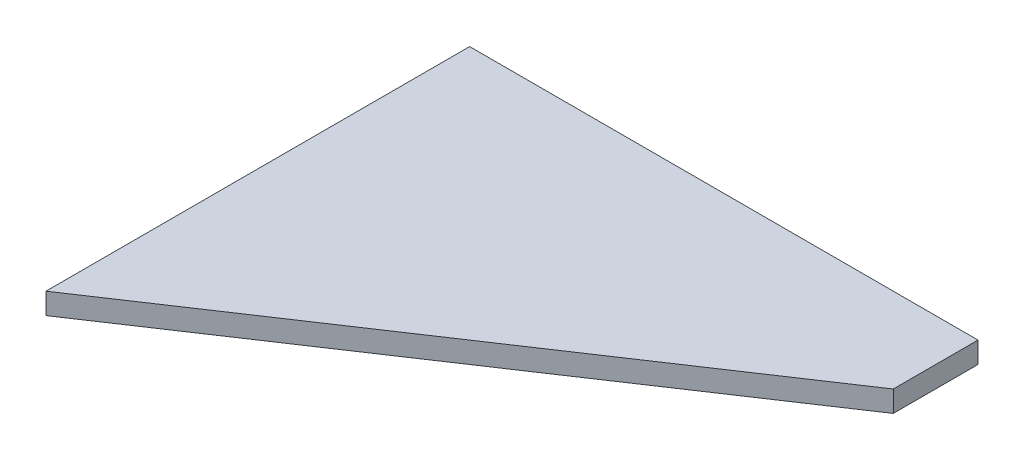
ISO-10303-21;
HEADER;
FILE_DESCRIPTION(('STEP AP214'),'2;1');
FILE_NAME('part.step','',(''),(''),'','','');
FILE_SCHEMA(('AUTOMOTIVE_DESIGN { 1 0 10303 214 1 1 1 1 }'));
ENDSEC;
DATA;
#1=APPLICATION_CONTEXT('core data for automotive mechanical design processes');
#2=APPLICATION_PROTOCOL_DEFINITION('international standard','automotive_design',2000,#1);
#3=PRODUCT_CONTEXT('',#1,'mechanical');
#4=PRODUCT('Part','Part','',(#3));
#5=PRODUCT_RELATED_PRODUCT_CATEGORY('part','',(#4));
#6=PRODUCT_DEFINITION_FORMATION('','',#4);
#7=PRODUCT_DEFINITION_CONTEXT('part definition',#1,'design');
#8=PRODUCT_DEFINITION('design','',#6,#7);
#9=PRODUCT_DEFINITION_SHAPE('','',#8);
#10=(LENGTH_UNIT() NAMED_UNIT(*) SI_UNIT(.MILLI.,.METRE.));
#11=(NAMED_UNIT(*) PLANE_ANGLE_UNIT() SI_UNIT($,.RADIAN.));
#12=(NAMED_UNIT(*) SI_UNIT($,.STERADIAN.) SOLID_ANGLE_UNIT());
#13=UNCERTAINTY_MEASURE_WITH_UNIT(LENGTH_MEASURE(1.E-05),#10,'distance_accuracy_value','');
#14=(GEOMETRIC_REPRESENTATION_CONTEXT(3) GLOBAL_UNCERTAINTY_ASSIGNED_CONTEXT((#13)) GLOBAL_UNIT_ASSIGNED_CONTEXT((#10,
#11,#12)) REPRESENTATION_CONTEXT('',''));
#15=CARTESIAN_POINT('',(0.,0.,0.));
#16=DIRECTION('',(0.,0.,1.));
#17=DIRECTION('',(1.,0.,0.));
#18=AXIS2_PLACEMENT_3D('',#15,#16,#17);
#19=CARTESIAN_POINT('',(0.,3.175,0.));
#20=DIRECTION('',(-1.,0.,0.));
#21=DIRECTION('',(0.,0.,1.));
#22=AXIS2_PLACEMENT_3D('',#19,#20,#21);
#23=PLANE('',#22);
#24=DIRECTION('',(0.,0.,-1.));
#25=VECTOR('',#24,1.);
#26=CARTESIAN_POINT('',(0.,0.,0.));
#27=LINE('',#26,#25);
#28=CARTESIAN_POINT('',(0.,0.,0.));
#29=VERTEX_POINT('',#28);
#30=CARTESIAN_POINT('',(0.,0.,-63.5));
#31=VERTEX_POINT('',#30);
#32=EDGE_CURVE('E96',#29,#31,#27,.T.);
#33=ORIENTED_EDGE('',*,*,#32,.F.);
#34=DIRECTION('',(0.,-1.,0.));
#35=VECTOR('',#34,1.);
#36=CARTESIAN_POINT('',(0.,3.175,0.));
#37=LINE('',#36,#35);
#38=CARTESIAN_POINT('',(0.,3.175,0.));
#39=VERTEX_POINT('',#38);
#40=EDGE_CURVE('E11',#39,#29,#37,.T.);
#41=ORIENTED_EDGE('',*,*,#40,.F.);
#42=DIRECTION('',(0.,0.,-1.));
#43=VECTOR('',#42,1.);
#44=CARTESIAN_POINT('',(0.,3.175,0.));
#45=LINE('',#44,#43);
#46=CARTESIAN_POINT('',(0.,3.175,-63.5));
#47=VERTEX_POINT('',#46);
#48=EDGE_CURVE('E90',#39,#47,#45,.T.);
#49=ORIENTED_EDGE('',*,*,#48,.T.);
#50=DIRECTION('',(0.,-1.,0.));
#51=VECTOR('',#50,1.);
#52=CARTESIAN_POINT('',(0.,3.175,-63.5));
#53=LINE('',#52,#51);
#54=EDGE_CURVE('E35',#47,#31,#53,.T.);
#55=ORIENTED_EDGE('',*,*,#54,.T.);
#56=EDGE_LOOP('',(#33,#41,#49,#55));
#57=FACE_BOUND('',#56,.T.);
#58=ADVANCED_FACE('F32',(#57),#23,.T.);
#59=CARTESIAN_POINT('',(76.2,3.175,-50.8));
#60=DIRECTION('',(0.554700196225229,0.,0.832050294337844));
#61=DIRECTION('',(0.832050294337844,0.,-0.554700196225229));
#62=AXIS2_PLACEMENT_3D('',#59,#60,#61);
#63=PLANE('',#62);
#64=DIRECTION('',(-0.832050294337844,0.,0.554700196225229));
#65=VECTOR('',#64,1.);
#66=CARTESIAN_POINT('',(76.2,0.,-50.8));
#67=LINE('',#66,#65);
#68=CARTESIAN_POINT('',(76.2,0.,-50.8));
#69=VERTEX_POINT('',#68);
#70=EDGE_CURVE('E92',#69,#29,#67,.T.);
#71=ORIENTED_EDGE('',*,*,#70,.F.);
#72=DIRECTION('',(0.,-1.,0.));
#73=VECTOR('',#72,1.);
#74=CARTESIAN_POINT('',(76.2,3.175,-50.8));
#75=LINE('',#74,#73);
#76=CARTESIAN_POINT('',(76.2,3.175,-50.8));
#77=VERTEX_POINT('',#76);
#78=EDGE_CURVE('E41',#77,#69,#75,.T.);
#79=ORIENTED_EDGE('',*,*,#78,.F.);
#80=DIRECTION('',(-0.832050294337844,0.,0.554700196225229));
#81=VECTOR('',#80,1.);
#82=CARTESIAN_POINT('',(76.2,3.175,-50.8));
#83=LINE('',#82,#81);
#84=EDGE_CURVE('E87',#77,#39,#83,.T.);
#85=ORIENTED_EDGE('',*,*,#84,.T.);
#86=ORIENTED_EDGE('',*,*,#40,.T.);
#87=EDGE_LOOP('',(#71,#79,#85,#86));
#88=FACE_BOUND('',#87,.T.);
#89=ADVANCED_FACE('F106',(#88),#63,.T.);
#90=CARTESIAN_POINT('',(76.2,3.175,-63.5));
#91=DIRECTION('',(1.,0.,0.));
#92=DIRECTION('',(0.,0.,-1.));
#93=AXIS2_PLACEMENT_3D('',#90,#91,#92);
#94=PLANE('',#93);
#95=DIRECTION('',(0.,0.,1.));
#96=VECTOR('',#95,1.);
#97=CARTESIAN_POINT('',(76.2,0.,-63.5));
#98=LINE('',#97,#96);
#99=CARTESIAN_POINT('',(76.2,0.,-63.5));
#100=VERTEX_POINT('',#99);
#101=EDGE_CURVE('E82',#100,#69,#98,.T.);
#102=ORIENTED_EDGE('',*,*,#101,.F.);
#103=DIRECTION('',(0.,-1.,0.));
#104=VECTOR('',#103,1.);
#105=CARTESIAN_POINT('',(76.2,3.175,-63.5));
#106=LINE('',#105,#104);
#107=CARTESIAN_POINT('',(76.2,3.175,-63.5));
#108=VERTEX_POINT('',#107);
#109=EDGE_CURVE('E77',#108,#100,#106,.T.);
#110=ORIENTED_EDGE('',*,*,#109,.F.);
#111=DIRECTION('',(0.,0.,1.));
#112=VECTOR('',#111,1.);
#113=CARTESIAN_POINT('',(76.2,3.175,-63.5));
#114=LINE('',#113,#112);
#115=EDGE_CURVE('E80',#108,#77,#114,.T.);
#116=ORIENTED_EDGE('',*,*,#115,.T.);
#117=ORIENTED_EDGE('',*,*,#78,.T.);
#118=EDGE_LOOP('',(#102,#110,#116,#117));
#119=FACE_BOUND('',#118,.T.);
#120=ADVANCED_FACE('F79',(#119),#94,.T.);
#121=CARTESIAN_POINT('',(0.,3.175,-63.5));
#122=DIRECTION('',(0.,0.,-1.));
#123=DIRECTION('',(-1.,0.,0.));
#124=AXIS2_PLACEMENT_3D('',#121,#122,#123);
#125=PLANE('',#124);
#126=DIRECTION('',(1.,0.,0.));
#127=VECTOR('',#126,1.);
#128=CARTESIAN_POINT('',(0.,0.,-63.5));
#129=LINE('',#128,#127);
#130=EDGE_CURVE('E99',#31,#100,#129,.T.);
#131=ORIENTED_EDGE('',*,*,#130,.F.);
#132=ORIENTED_EDGE('',*,*,#54,.F.);
#133=DIRECTION('',(1.,0.,0.));
#134=VECTOR('',#133,1.);
#135=CARTESIAN_POINT('',(0.,3.175,-63.5));
#136=LINE('',#135,#134);
#137=EDGE_CURVE('E86',#47,#108,#136,.T.);
#138=ORIENTED_EDGE('',*,*,#137,.T.);
#139=ORIENTED_EDGE('',*,*,#109,.T.);
#140=EDGE_LOOP('',(#131,#132,#138,#139));
#141=FACE_BOUND('',#140,.T.);
#142=ADVANCED_FACE('F89',(#141),#125,.T.);
#143=CARTESIAN_POINT('',(0.,3.175,0.));
#144=DIRECTION('',(0.,-1.,0.));
#145=DIRECTION('',(0.,0.,-1.));
#146=AXIS2_PLACEMENT_3D('',#143,#144,#145);
#147=PLANE('',#146);
#148=ORIENTED_EDGE('',*,*,#48,.F.);
#149=ORIENTED_EDGE('',*,*,#84,.F.);
#150=ORIENTED_EDGE('',*,*,#115,.F.);
#151=ORIENTED_EDGE('',*,*,#137,.F.);
#152=EDGE_LOOP('',(#148,#149,#150,#151));
#153=FACE_BOUND('',#152,.T.);
#154=ADVANCED_FACE('F85',(#153),#147,.F.);
#155=CARTESIAN_POINT('',(0.,0.,0.));
#156=DIRECTION('',(0.,-1.,0.));
#157=DIRECTION('',(0.,0.,-1.));
#158=AXIS2_PLACEMENT_3D('',#155,#156,#157);
#159=PLANE('',#158);
#160=ORIENTED_EDGE('',*,*,#32,.T.);
#161=ORIENTED_EDGE('',*,*,#130,.T.);
#162=ORIENTED_EDGE('',*,*,#101,.T.);
#163=ORIENTED_EDGE('',*,*,#70,.T.);
#164=EDGE_LOOP('',(#160,#161,#162,#163));
#165=FACE_BOUND('',#164,.T.);
#166=ADVANCED_FACE('F105',(#165),#159,.T.);
#167=CLOSED_SHELL('',(#58,#89,#120,#142,#154,#166));
#168=MANIFOLD_SOLID_BREP('B2',#167);
#169=ADVANCED_BREP_SHAPE_REPRESENTATION('',(#18,#168),#14);
#170=SHAPE_DEFINITION_REPRESENTATION(#9,#169);
ENDSEC;
END-ISO-10303-21;
